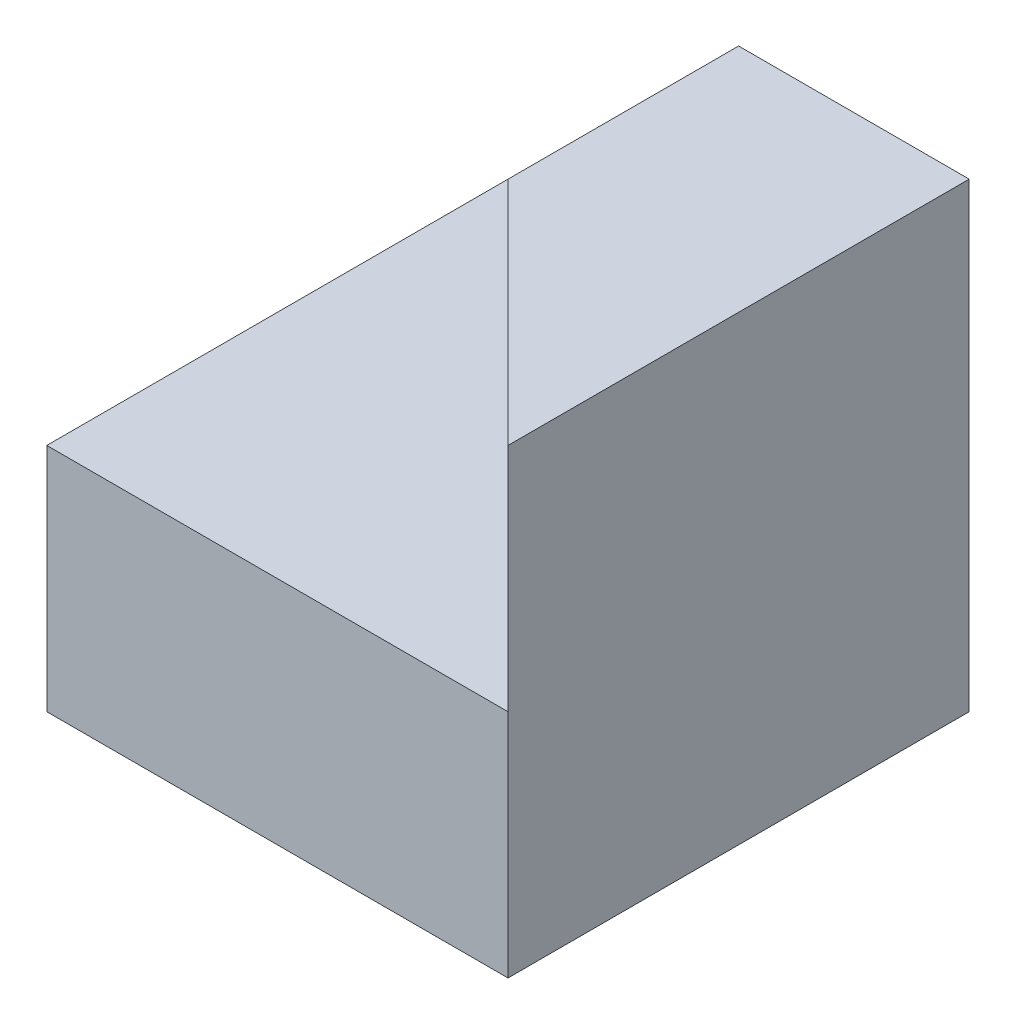
ISO-10303-21;
HEADER;
FILE_DESCRIPTION(('STEP AP214'),'2;1');
FILE_NAME('part.step','',(''),(''),'','','');
FILE_SCHEMA(('AUTOMOTIVE_DESIGN { 1 0 10303 214 1 1 1 1 }'));
ENDSEC;
DATA;
#1=APPLICATION_CONTEXT('core data for automotive mechanical design processes');
#2=APPLICATION_PROTOCOL_DEFINITION('international standard','automotive_design',2000,#1);
#3=PRODUCT_CONTEXT('',#1,'mechanical');
#4=PRODUCT('Part','Part','',(#3));
#5=PRODUCT_RELATED_PRODUCT_CATEGORY('part','',(#4));
#6=PRODUCT_DEFINITION_FORMATION('','',#4);
#7=PRODUCT_DEFINITION_CONTEXT('part definition',#1,'design');
#8=PRODUCT_DEFINITION('design','',#6,#7);
#9=PRODUCT_DEFINITION_SHAPE('','',#8);
#10=(LENGTH_UNIT() NAMED_UNIT(*) SI_UNIT(.MILLI.,.METRE.));
#11=(NAMED_UNIT(*) PLANE_ANGLE_UNIT() SI_UNIT($,.RADIAN.));
#12=(NAMED_UNIT(*) SI_UNIT($,.STERADIAN.) SOLID_ANGLE_UNIT());
#13=UNCERTAINTY_MEASURE_WITH_UNIT(LENGTH_MEASURE(1.E-05),#10,'distance_accuracy_value','');
#14=(GEOMETRIC_REPRESENTATION_CONTEXT(3) GLOBAL_UNCERTAINTY_ASSIGNED_CONTEXT((#13)) GLOBAL_UNIT_ASSIGNED_CONTEXT((#10,
#11,#12)) REPRESENTATION_CONTEXT('',''));
#15=CARTESIAN_POINT('',(0.,0.,0.));
#16=DIRECTION('',(0.,0.,1.));
#17=DIRECTION('',(1.,0.,0.));
#18=AXIS2_PLACEMENT_3D('',#15,#16,#17);
#19=CARTESIAN_POINT('',(0.,0.,40.));
#20=DIRECTION('',(0.,0.,-1.));
#21=DIRECTION('',(-1.,0.,0.));
#22=AXIS2_PLACEMENT_3D('',#19,#20,#21);
#23=PLANE('',#22);
#24=DIRECTION('',(0.,1.,0.));
#25=VECTOR('',#24,1.);
#26=CARTESIAN_POINT('',(40.,0.,40.));
#27=LINE('',#26,#25);
#28=CARTESIAN_POINT('',(40.,0.,40.));
#29=VERTEX_POINT('',#28);
#30=CARTESIAN_POINT('',(40.,20.,40.));
#31=VERTEX_POINT('',#30);
#32=EDGE_CURVE('E99',#29,#31,#27,.T.);
#33=ORIENTED_EDGE('',*,*,#32,.T.);
#34=DIRECTION('',(-1.,0.,0.));
#35=VECTOR('',#34,1.);
#36=CARTESIAN_POINT('',(0.,20.,40.));
#37=LINE('',#36,#35);
#38=CARTESIAN_POINT('',(0.,20.,40.));
#39=VERTEX_POINT('',#38);
#40=EDGE_CURVE('E91',#31,#39,#37,.T.);
#41=ORIENTED_EDGE('',*,*,#40,.T.);
#42=DIRECTION('',(0.,-1.,0.));
#43=VECTOR('',#42,1.);
#44=CARTESIAN_POINT('',(0.,0.,40.));
#45=LINE('',#44,#43);
#46=CARTESIAN_POINT('',(0.,0.,40.));
#47=VERTEX_POINT('',#46);
#48=EDGE_CURVE('E122',#39,#47,#45,.T.);
#49=ORIENTED_EDGE('',*,*,#48,.T.);
#50=DIRECTION('',(1.,0.,0.));
#51=VECTOR('',#50,1.);
#52=CARTESIAN_POINT('',(0.,0.,40.));
#53=LINE('',#52,#51);
#54=EDGE_CURVE('E119',#47,#29,#53,.T.);
#55=ORIENTED_EDGE('',*,*,#54,.T.);
#56=EDGE_LOOP('',(#33,#41,#49,#55));
#57=FACE_BOUND('',#56,.T.);
#58=ADVANCED_FACE('F35',(#57),#23,.F.);
#59=CARTESIAN_POINT('',(40.,40.,0.));
#60=DIRECTION('',(0.,1.,0.));
#61=DIRECTION('',(-1.,0.,0.));
#62=AXIS2_PLACEMENT_3D('',#59,#60,#61);
#63=PLANE('',#62);
#64=DIRECTION('',(0.,0.,1.));
#65=VECTOR('',#64,1.);
#66=CARTESIAN_POINT('',(20.,40.,0.));
#67=LINE('',#66,#65);
#68=CARTESIAN_POINT('',(20.,40.,0.));
#69=VERTEX_POINT('',#68);
#70=CARTESIAN_POINT('',(20.,40.,20.));
#71=VERTEX_POINT('',#70);
#72=EDGE_CURVE('E132',#69,#71,#67,.T.);
#73=ORIENTED_EDGE('',*,*,#72,.T.);
#74=DIRECTION('',(0.707106781186547,0.,0.707106781186548));
#75=VECTOR('',#74,1.);
#76=CARTESIAN_POINT('',(0.,40.,0.));
#77=LINE('',#76,#75);
#78=CARTESIAN_POINT('',(40.,40.,40.));
#79=VERTEX_POINT('',#78);
#80=EDGE_CURVE('E108',#71,#79,#77,.T.);
#81=ORIENTED_EDGE('',*,*,#80,.T.);
#82=DIRECTION('',(0.,0.,1.));
#83=VECTOR('',#82,1.);
#84=CARTESIAN_POINT('',(40.,40.,0.));
#85=LINE('',#84,#83);
#86=CARTESIAN_POINT('',(40.,40.,0.));
#87=VERTEX_POINT('',#86);
#88=EDGE_CURVE('E116',#87,#79,#85,.T.);
#89=ORIENTED_EDGE('',*,*,#88,.F.);
#90=DIRECTION('',(-1.,0.,0.));
#91=VECTOR('',#90,1.);
#92=CARTESIAN_POINT('',(0.,40.,0.));
#93=LINE('',#92,#91);
#94=EDGE_CURVE('E117',#87,#69,#93,.T.);
#95=ORIENTED_EDGE('',*,*,#94,.T.);
#96=EDGE_LOOP('',(#73,#81,#89,#95));
#97=FACE_BOUND('',#96,.T.);
#98=ADVANCED_FACE('F158',(#97),#63,.T.);
#99=CARTESIAN_POINT('',(20.,20.,0.));
#100=DIRECTION('',(-1.,0.,0.));
#101=DIRECTION('',(0.,0.,1.));
#102=AXIS2_PLACEMENT_3D('',#99,#100,#101);
#103=PLANE('',#102);
#104=DIRECTION('',(0.,0.,1.));
#105=VECTOR('',#104,1.);
#106=CARTESIAN_POINT('',(20.,20.,0.));
#107=LINE('',#106,#105);
#108=CARTESIAN_POINT('',(20.,20.,0.));
#109=VERTEX_POINT('',#108);
#110=CARTESIAN_POINT('',(20.,20.,20.));
#111=VERTEX_POINT('',#110);
#112=EDGE_CURVE('E58',#109,#111,#107,.T.);
#113=ORIENTED_EDGE('',*,*,#112,.T.);
#114=DIRECTION('',(0.,1.,0.));
#115=VECTOR('',#114,1.);
#116=CARTESIAN_POINT('',(20.,20.,20.));
#117=LINE('',#116,#115);
#118=EDGE_CURVE('E107',#111,#71,#117,.T.);
#119=ORIENTED_EDGE('',*,*,#118,.T.);
#120=ORIENTED_EDGE('',*,*,#72,.F.);
#121=DIRECTION('',(0.,-1.,0.));
#122=VECTOR('',#121,1.);
#123=CARTESIAN_POINT('',(20.,40.,0.));
#124=LINE('',#123,#122);
#125=EDGE_CURVE('E136',#69,#109,#124,.T.);
#126=ORIENTED_EDGE('',*,*,#125,.T.);
#127=EDGE_LOOP('',(#113,#119,#120,#126));
#128=FACE_BOUND('',#127,.T.);
#129=ADVANCED_FACE('F160',(#128),#103,.T.);
#130=CARTESIAN_POINT('',(0.,0.,0.));
#131=DIRECTION('',(0.,0.,-1.));
#132=DIRECTION('',(-1.,0.,0.));
#133=AXIS2_PLACEMENT_3D('',#130,#131,#132);
#134=PLANE('',#133);
#135=DIRECTION('',(-1.,0.,0.));
#136=VECTOR('',#135,1.);
#137=CARTESIAN_POINT('',(0.,20.,0.));
#138=LINE('',#137,#136);
#139=CARTESIAN_POINT('',(0.,20.,0.));
#140=VERTEX_POINT('',#139);
#141=EDGE_CURVE('E39',#109,#140,#138,.T.);
#142=ORIENTED_EDGE('',*,*,#141,.F.);
#143=ORIENTED_EDGE('',*,*,#125,.F.);
#144=ORIENTED_EDGE('',*,*,#94,.F.);
#145=DIRECTION('',(0.,1.,0.));
#146=VECTOR('',#145,1.);
#147=CARTESIAN_POINT('',(40.,0.,0.));
#148=LINE('',#147,#146);
#149=CARTESIAN_POINT('',(40.,0.,0.));
#150=VERTEX_POINT('',#149);
#151=EDGE_CURVE('E141',#150,#87,#148,.T.);
#152=ORIENTED_EDGE('',*,*,#151,.F.);
#153=DIRECTION('',(1.,0.,0.));
#154=VECTOR('',#153,1.);
#155=CARTESIAN_POINT('',(0.,0.,0.));
#156=LINE('',#155,#154);
#157=CARTESIAN_POINT('',(0.,0.,0.));
#158=VERTEX_POINT('',#157);
#159=EDGE_CURVE('E142',#158,#150,#156,.T.);
#160=ORIENTED_EDGE('',*,*,#159,.F.);
#161=DIRECTION('',(0.,-1.,0.));
#162=VECTOR('',#161,1.);
#163=CARTESIAN_POINT('',(0.,0.,0.));
#164=LINE('',#163,#162);
#165=EDGE_CURVE('E128',#140,#158,#164,.T.);
#166=ORIENTED_EDGE('',*,*,#165,.F.);
#167=EDGE_LOOP('',(#142,#143,#144,#152,#160,#166));
#168=FACE_BOUND('',#167,.T.);
#169=ADVANCED_FACE('F150',(#168),#134,.T.);
#170=CARTESIAN_POINT('',(40.,0.,40.));
#171=DIRECTION('',(-1.,0.,0.));
#172=DIRECTION('',(0.,0.,1.));
#173=AXIS2_PLACEMENT_3D('',#170,#171,#172);
#174=PLANE('',#173);
#175=ORIENTED_EDGE('',*,*,#88,.T.);
#176=DIRECTION('',(0.,1.,0.));
#177=VECTOR('',#176,1.);
#178=CARTESIAN_POINT('',(40.,20.,40.));
#179=LINE('',#178,#177);
#180=EDGE_CURVE('E104',#31,#79,#179,.T.);
#181=ORIENTED_EDGE('',*,*,#180,.F.);
#182=ORIENTED_EDGE('',*,*,#32,.F.);
#183=DIRECTION('',(0.,0.,-1.));
#184=VECTOR('',#183,1.);
#185=CARTESIAN_POINT('',(40.,0.,40.));
#186=LINE('',#185,#184);
#187=EDGE_CURVE('E45',#29,#150,#186,.T.);
#188=ORIENTED_EDGE('',*,*,#187,.T.);
#189=ORIENTED_EDGE('',*,*,#151,.T.);
#190=EDGE_LOOP('',(#175,#181,#182,#188,#189));
#191=FACE_BOUND('',#190,.T.);
#192=ADVANCED_FACE('F113',(#191),#174,.F.);
#193=CARTESIAN_POINT('',(0.,20.,40.));
#194=DIRECTION('',(0.,-1.,0.));
#195=DIRECTION('',(0.,0.,-1.));
#196=AXIS2_PLACEMENT_3D('',#193,#194,#195);
#197=PLANE('',#196);
#198=ORIENTED_EDGE('',*,*,#112,.F.);
#199=ORIENTED_EDGE('',*,*,#141,.T.);
#200=DIRECTION('',(0.,0.,-1.));
#201=VECTOR('',#200,1.);
#202=CARTESIAN_POINT('',(0.,20.,40.));
#203=LINE('',#202,#201);
#204=EDGE_CURVE('E94',#39,#140,#203,.T.);
#205=ORIENTED_EDGE('',*,*,#204,.F.);
#206=ORIENTED_EDGE('',*,*,#40,.F.);
#207=DIRECTION('',(0.707106781186547,0.,0.707106781186548));
#208=VECTOR('',#207,1.);
#209=CARTESIAN_POINT('',(0.,20.,0.));
#210=LINE('',#209,#208);
#211=EDGE_CURVE('E53',#111,#31,#210,.T.);
#212=ORIENTED_EDGE('',*,*,#211,.F.);
#213=EDGE_LOOP('',(#198,#199,#205,#206,#212));
#214=FACE_BOUND('',#213,.T.);
#215=ADVANCED_FACE('F92',(#214),#197,.F.);
#216=CARTESIAN_POINT('',(0.,0.,40.));
#217=DIRECTION('',(1.,0.,0.));
#218=DIRECTION('',(0.,0.,-1.));
#219=AXIS2_PLACEMENT_3D('',#216,#217,#218);
#220=PLANE('',#219);
#221=ORIENTED_EDGE('',*,*,#165,.T.);
#222=DIRECTION('',(0.,0.,-1.));
#223=VECTOR('',#222,1.);
#224=CARTESIAN_POINT('',(0.,0.,40.));
#225=LINE('',#224,#223);
#226=EDGE_CURVE('E11',#47,#158,#225,.T.);
#227=ORIENTED_EDGE('',*,*,#226,.F.);
#228=ORIENTED_EDGE('',*,*,#48,.F.);
#229=ORIENTED_EDGE('',*,*,#204,.T.);
#230=EDGE_LOOP('',(#221,#227,#228,#229));
#231=FACE_BOUND('',#230,.T.);
#232=ADVANCED_FACE('F37',(#231),#220,.F.);
#233=CARTESIAN_POINT('',(0.,0.,40.));
#234=DIRECTION('',(0.,1.,0.));
#235=DIRECTION('',(0.,0.,1.));
#236=AXIS2_PLACEMENT_3D('',#233,#234,#235);
#237=PLANE('',#236);
#238=ORIENTED_EDGE('',*,*,#159,.T.);
#239=ORIENTED_EDGE('',*,*,#187,.F.);
#240=ORIENTED_EDGE('',*,*,#54,.F.);
#241=ORIENTED_EDGE('',*,*,#226,.T.);
#242=EDGE_LOOP('',(#238,#239,#240,#241));
#243=FACE_BOUND('',#242,.T.);
#244=ADVANCED_FACE('F178',(#243),#237,.F.);
#245=CARTESIAN_POINT('',(0.,20.,0.));
#246=DIRECTION('',(-0.707106781186548,0.,0.707106781186547));
#247=DIRECTION('',(0.707106781186547,0.,0.707106781186548));
#248=AXIS2_PLACEMENT_3D('',#245,#246,#247);
#249=PLANE('',#248);
#250=ORIENTED_EDGE('',*,*,#80,.F.);
#251=ORIENTED_EDGE('',*,*,#118,.F.);
#252=ORIENTED_EDGE('',*,*,#211,.T.);
#253=ORIENTED_EDGE('',*,*,#180,.T.);
#254=EDGE_LOOP('',(#250,#251,#252,#253));
#255=FACE_BOUND('',#254,.T.);
#256=ADVANCED_FACE('F103',(#255),#249,.T.);
#257=CLOSED_SHELL('',(#58,#98,#129,#169,#192,#215,#232,#244,#256));
#258=MANIFOLD_SOLID_BREP('B2',#257);
#259=ADVANCED_BREP_SHAPE_REPRESENTATION('',(#18,#258),#14);
#260=SHAPE_DEFINITION_REPRESENTATION(#9,#259);
ENDSEC;
END-ISO-10303-21;
